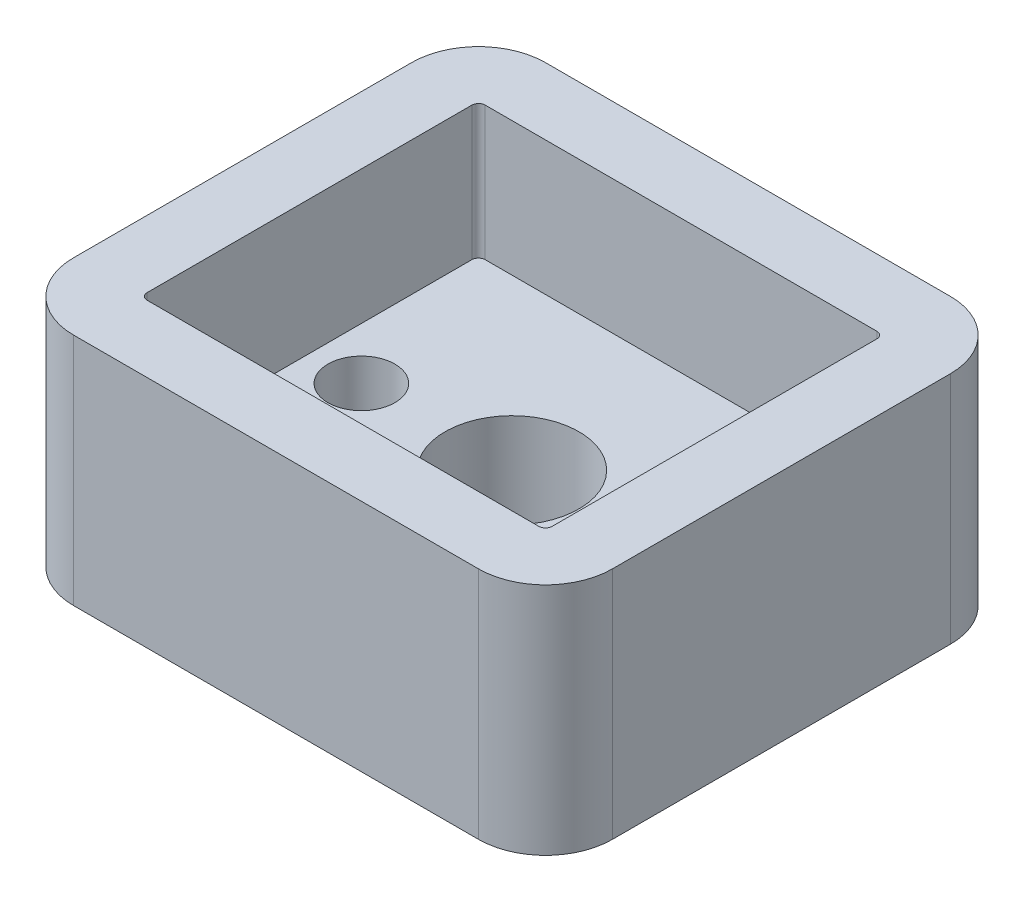
ISO-10303-21;
HEADER;
FILE_DESCRIPTION(('STEP AP214'),'2;1');
FILE_NAME('part.step','',(''),(''),'','','');
FILE_SCHEMA(('AUTOMOTIVE_DESIGN { 1 0 10303 214 1 1 1 1 }'));
ENDSEC;
DATA;
#1=APPLICATION_CONTEXT('core data for automotive mechanical design processes');
#2=APPLICATION_PROTOCOL_DEFINITION('international standard','automotive_design',2000,#1);
#3=PRODUCT_CONTEXT('',#1,'mechanical');
#4=PRODUCT('Part','Part','',(#3));
#5=PRODUCT_RELATED_PRODUCT_CATEGORY('part','',(#4));
#6=PRODUCT_DEFINITION_FORMATION('','',#4);
#7=PRODUCT_DEFINITION_CONTEXT('part definition',#1,'design');
#8=PRODUCT_DEFINITION('design','',#6,#7);
#9=PRODUCT_DEFINITION_SHAPE('','',#8);
#10=(LENGTH_UNIT() NAMED_UNIT(*) SI_UNIT(.MILLI.,.METRE.));
#11=(NAMED_UNIT(*) PLANE_ANGLE_UNIT() SI_UNIT($,.RADIAN.));
#12=(NAMED_UNIT(*) SI_UNIT($,.STERADIAN.) SOLID_ANGLE_UNIT());
#13=UNCERTAINTY_MEASURE_WITH_UNIT(LENGTH_MEASURE(1.E-05),#10,'distance_accuracy_value','');
#14=(GEOMETRIC_REPRESENTATION_CONTEXT(3) GLOBAL_UNCERTAINTY_ASSIGNED_CONTEXT((#13)) GLOBAL_UNIT_ASSIGNED_CONTEXT((#10,
#11,#12)) REPRESENTATION_CONTEXT('',''));
#15=CARTESIAN_POINT('',(0.,0.,0.));
#16=DIRECTION('',(0.,0.,1.));
#17=DIRECTION('',(1.,0.,0.));
#18=AXIS2_PLACEMENT_3D('',#15,#16,#17);
#19=CARTESIAN_POINT('',(0.,0.,0.));
#20=DIRECTION('',(0.,1.,0.));
#21=DIRECTION('',(0.,0.,1.));
#22=AXIS2_PLACEMENT_3D('',#19,#20,#21);
#23=PLANE('',#22);
#24=CARTESIAN_POINT('',(0.,0.,0.));
#25=DIRECTION('',(0.,1.,0.));
#26=DIRECTION('',(0.,0.,1.));
#27=AXIS2_PLACEMENT_3D('',#24,#25,#26);
#28=CIRCLE('',#27,2.);
#29=CARTESIAN_POINT('',(0.,0.,2.));
#30=VERTEX_POINT('',#29);
#31=EDGE_CURVE('E622',#30,#30,#28,.T.);
#32=ORIENTED_EDGE('',*,*,#31,.T.);
#33=EDGE_LOOP('',(#32));
#34=FACE_BOUND('',#33,.T.);
#35=CARTESIAN_POINT('',(4.5,0.,0.));
#36=DIRECTION('',(0.,-1.,0.));
#37=DIRECTION('',(0.,0.,-1.));
#38=AXIS2_PLACEMENT_3D('',#35,#36,#37);
#39=CIRCLE('',#38,2.);
#40=CARTESIAN_POINT('',(4.5,0.,-2.));
#41=VERTEX_POINT('',#40);
#42=EDGE_CURVE('E606',#41,#41,#39,.T.);
#43=ORIENTED_EDGE('',*,*,#42,.F.);
#44=EDGE_LOOP('',(#43));
#45=FACE_BOUND('',#44,.T.);
#46=DIRECTION('',(0.,0.,1.));
#47=VECTOR('',#46,1.);
#48=CARTESIAN_POINT('',(-8.05,0.,-7.05));
#49=LINE('',#48,#47);
#50=CARTESIAN_POINT('',(-8.05,0.,-5.05));
#51=VERTEX_POINT('',#50);
#52=CARTESIAN_POINT('',(-8.05,0.,5.05));
#53=VERTEX_POINT('',#52);
#54=EDGE_CURVE('E170',#51,#53,#49,.T.);
#55=ORIENTED_EDGE('',*,*,#54,.F.);
#56=CARTESIAN_POINT('',(-6.05,0.,-5.05));
#57=DIRECTION('',(0.,1.,0.));
#58=DIRECTION('',(0.,0.,1.));
#59=AXIS2_PLACEMENT_3D('',#56,#57,#58);
#60=CIRCLE('',#59,2.);
#61=CARTESIAN_POINT('',(-6.05,0.,-7.05));
#62=VERTEX_POINT('',#61);
#63=EDGE_CURVE('E152',#51,#62,#60,.F.);
#64=ORIENTED_EDGE('',*,*,#63,.T.);
#65=DIRECTION('',(-1.,0.,0.));
#66=VECTOR('',#65,1.);
#67=CARTESIAN_POINT('',(-8.05,0.,-7.05));
#68=LINE('',#67,#66);
#69=CARTESIAN_POINT('',(6.05,0.,-7.05));
#70=VERTEX_POINT('',#69);
#71=EDGE_CURVE('E200',#70,#62,#68,.T.);
#72=ORIENTED_EDGE('',*,*,#71,.F.);
#73=CARTESIAN_POINT('',(6.05,0.,-5.05));
#74=DIRECTION('',(0.,1.,0.));
#75=DIRECTION('',(0.,0.,1.));
#76=AXIS2_PLACEMENT_3D('',#73,#74,#75);
#77=CIRCLE('',#76,2.);
#78=CARTESIAN_POINT('',(8.05,0.,-5.05));
#79=VERTEX_POINT('',#78);
#80=EDGE_CURVE('E175',#70,#79,#77,.F.);
#81=ORIENTED_EDGE('',*,*,#80,.T.);
#82=DIRECTION('',(0.,0.,-1.));
#83=VECTOR('',#82,1.);
#84=CARTESIAN_POINT('',(8.05,0.,-7.05));
#85=LINE('',#84,#83);
#86=CARTESIAN_POINT('',(8.05,0.,5.05));
#87=VERTEX_POINT('',#86);
#88=EDGE_CURVE('E188',#87,#79,#85,.T.);
#89=ORIENTED_EDGE('',*,*,#88,.F.);
#90=CARTESIAN_POINT('',(6.05,0.,5.05));
#91=DIRECTION('',(0.,1.,0.));
#92=DIRECTION('',(0.,0.,1.));
#93=AXIS2_PLACEMENT_3D('',#90,#91,#92);
#94=CIRCLE('',#93,2.);
#95=CARTESIAN_POINT('',(6.05,0.,7.05));
#96=VERTEX_POINT('',#95);
#97=EDGE_CURVE('E164',#87,#96,#94,.F.);
#98=ORIENTED_EDGE('',*,*,#97,.T.);
#99=DIRECTION('',(1.,0.,0.));
#100=VECTOR('',#99,1.);
#101=CARTESIAN_POINT('',(-8.05,0.,7.05));
#102=LINE('',#101,#100);
#103=CARTESIAN_POINT('',(-6.05,0.,7.05));
#104=VERTEX_POINT('',#103);
#105=EDGE_CURVE('E182',#104,#96,#102,.T.);
#106=ORIENTED_EDGE('',*,*,#105,.F.);
#107=CARTESIAN_POINT('',(-6.05,0.,5.05));
#108=DIRECTION('',(0.,1.,0.));
#109=DIRECTION('',(0.,0.,1.));
#110=AXIS2_PLACEMENT_3D('',#107,#108,#109);
#111=CIRCLE('',#110,2.);
#112=EDGE_CURVE('E180',#104,#53,#111,.F.);
#113=ORIENTED_EDGE('',*,*,#112,.T.);
#114=EDGE_LOOP('',(#55,#64,#72,#81,#89,#98,#106,#113));
#115=FACE_BOUND('',#114,.T.);
#116=CARTESIAN_POINT('',(-4.5,0.,0.));
#117=DIRECTION('',(0.,-1.,0.));
#118=DIRECTION('',(0.,0.,-1.));
#119=AXIS2_PLACEMENT_3D('',#116,#117,#118);
#120=CIRCLE('',#119,2.);
#121=CARTESIAN_POINT('',(-4.5,0.,-2.));
#122=VERTEX_POINT('',#121);
#123=EDGE_CURVE('E618',#122,#122,#120,.T.);
#124=ORIENTED_EDGE('',*,*,#123,.F.);
#125=EDGE_LOOP('',(#124));
#126=FACE_BOUND('',#125,.T.);
#127=ADVANCED_FACE('F39',(#34,#45,#115,#126),#23,.F.);
#128=CARTESIAN_POINT('',(-8.05,7.,-7.05));
#129=DIRECTION('',(1.,0.,0.));
#130=DIRECTION('',(0.,0.,-1.));
#131=AXIS2_PLACEMENT_3D('',#128,#129,#130);
#132=PLANE('',#131);
#133=DIRECTION('',(0.,0.,1.));
#134=VECTOR('',#133,1.);
#135=CARTESIAN_POINT('',(-8.05,7.,-7.05));
#136=LINE('',#135,#134);
#137=CARTESIAN_POINT('',(-8.05,7.,-5.05));
#138=VERTEX_POINT('',#137);
#139=CARTESIAN_POINT('',(-8.05,7.,5.05));
#140=VERTEX_POINT('',#139);
#141=EDGE_CURVE('E173',#138,#140,#136,.T.);
#142=ORIENTED_EDGE('',*,*,#141,.F.);
#143=DIRECTION('',(0.,-1.,0.));
#144=VECTOR('',#143,1.);
#145=CARTESIAN_POINT('',(-8.05,7.,-5.05));
#146=LINE('',#145,#144);
#147=EDGE_CURVE('E156',#138,#51,#146,.T.);
#148=ORIENTED_EDGE('',*,*,#147,.T.);
#149=ORIENTED_EDGE('',*,*,#54,.T.);
#150=DIRECTION('',(0.,-1.,0.));
#151=VECTOR('',#150,1.);
#152=CARTESIAN_POINT('',(-8.05,7.,5.05));
#153=LINE('',#152,#151);
#154=EDGE_CURVE('E176',#53,#140,#153,.F.);
#155=ORIENTED_EDGE('',*,*,#154,.T.);
#156=EDGE_LOOP('',(#142,#148,#149,#155));
#157=FACE_BOUND('',#156,.T.);
#158=ADVANCED_FACE('F169',(#157),#132,.F.);
#159=CARTESIAN_POINT('',(-8.05,7.,7.05));
#160=DIRECTION('',(0.,0.,-1.));
#161=DIRECTION('',(-1.,0.,0.));
#162=AXIS2_PLACEMENT_3D('',#159,#160,#161);
#163=PLANE('',#162);
#164=ORIENTED_EDGE('',*,*,#105,.T.);
#165=DIRECTION('',(0.,-1.,0.));
#166=VECTOR('',#165,1.);
#167=CARTESIAN_POINT('',(6.05,7.,7.05));
#168=LINE('',#167,#166);
#169=CARTESIAN_POINT('',(6.05,7.,7.05));
#170=VERTEX_POINT('',#169);
#171=EDGE_CURVE('E239',#96,#170,#168,.F.);
#172=ORIENTED_EDGE('',*,*,#171,.T.);
#173=DIRECTION('',(1.,0.,0.));
#174=VECTOR('',#173,1.);
#175=CARTESIAN_POINT('',(-8.05,7.,7.05));
#176=LINE('',#175,#174);
#177=CARTESIAN_POINT('',(-6.05,7.,7.05));
#178=VERTEX_POINT('',#177);
#179=EDGE_CURVE('E343',#178,#170,#176,.T.);
#180=ORIENTED_EDGE('',*,*,#179,.F.);
#181=DIRECTION('',(0.,-1.,0.));
#182=VECTOR('',#181,1.);
#183=CARTESIAN_POINT('',(-6.05,7.,7.05));
#184=LINE('',#183,#182);
#185=EDGE_CURVE('E235',#178,#104,#184,.T.);
#186=ORIENTED_EDGE('',*,*,#185,.T.);
#187=EDGE_LOOP('',(#164,#172,#180,#186));
#188=FACE_BOUND('',#187,.T.);
#189=ADVANCED_FACE('F369',(#188),#163,.F.);
#190=CARTESIAN_POINT('',(8.05,7.,-7.05));
#191=DIRECTION('',(-1.,0.,0.));
#192=DIRECTION('',(0.,0.,1.));
#193=AXIS2_PLACEMENT_3D('',#190,#191,#192);
#194=PLANE('',#193);
#195=DIRECTION('',(0.,0.,-1.));
#196=VECTOR('',#195,1.);
#197=CARTESIAN_POINT('',(8.05,7.,-7.05));
#198=LINE('',#197,#196);
#199=CARTESIAN_POINT('',(8.05,7.,5.05));
#200=VERTEX_POINT('',#199);
#201=CARTESIAN_POINT('',(8.05,7.,-5.05));
#202=VERTEX_POINT('',#201);
#203=EDGE_CURVE('E346',#200,#202,#198,.T.);
#204=ORIENTED_EDGE('',*,*,#203,.F.);
#205=DIRECTION('',(0.,-1.,0.));
#206=VECTOR('',#205,1.);
#207=CARTESIAN_POINT('',(8.05,7.,5.05));
#208=LINE('',#207,#206);
#209=EDGE_CURVE('E231',#200,#87,#208,.T.);
#210=ORIENTED_EDGE('',*,*,#209,.T.);
#211=ORIENTED_EDGE('',*,*,#88,.T.);
#212=DIRECTION('',(0.,-1.,0.));
#213=VECTOR('',#212,1.);
#214=CARTESIAN_POINT('',(8.05,7.,-5.05));
#215=LINE('',#214,#213);
#216=EDGE_CURVE('E228',#79,#202,#215,.F.);
#217=ORIENTED_EDGE('',*,*,#216,.T.);
#218=EDGE_LOOP('',(#204,#210,#211,#217));
#219=FACE_BOUND('',#218,.T.);
#220=ADVANCED_FACE('F362',(#219),#194,.F.);
#221=CARTESIAN_POINT('',(-8.05,7.,-7.05));
#222=DIRECTION('',(0.,0.,1.));
#223=DIRECTION('',(1.,0.,0.));
#224=AXIS2_PLACEMENT_3D('',#221,#222,#223);
#225=PLANE('',#224);
#226=ORIENTED_EDGE('',*,*,#71,.T.);
#227=DIRECTION('',(0.,-1.,0.));
#228=VECTOR('',#227,1.);
#229=CARTESIAN_POINT('',(-6.05,7.,-7.05));
#230=LINE('',#229,#228);
#231=CARTESIAN_POINT('',(-6.05,7.,-7.05));
#232=VERTEX_POINT('',#231);
#233=EDGE_CURVE('E157',#62,#232,#230,.F.);
#234=ORIENTED_EDGE('',*,*,#233,.T.);
#235=DIRECTION('',(-1.,0.,0.));
#236=VECTOR('',#235,1.);
#237=CARTESIAN_POINT('',(-8.05,7.,-7.05));
#238=LINE('',#237,#236);
#239=CARTESIAN_POINT('',(6.05,7.,-7.05));
#240=VERTEX_POINT('',#239);
#241=EDGE_CURVE('E194',#240,#232,#238,.T.);
#242=ORIENTED_EDGE('',*,*,#241,.F.);
#243=DIRECTION('',(0.,-1.,0.));
#244=VECTOR('',#243,1.);
#245=CARTESIAN_POINT('',(6.05,7.,-7.05));
#246=LINE('',#245,#244);
#247=EDGE_CURVE('E163',#240,#70,#246,.T.);
#248=ORIENTED_EDGE('',*,*,#247,.T.);
#249=EDGE_LOOP('',(#226,#234,#242,#248));
#250=FACE_BOUND('',#249,.T.);
#251=ADVANCED_FACE('F356',(#250),#225,.F.);
#252=CARTESIAN_POINT('',(0.,7.,0.));
#253=DIRECTION('',(0.,1.,0.));
#254=DIRECTION('',(0.,0.,1.));
#255=AXIS2_PLACEMENT_3D('',#252,#253,#254);
#256=PLANE('',#255);
#257=DIRECTION('',(0.,0.,1.));
#258=VECTOR('',#257,1.);
#259=CARTESIAN_POINT('',(-6.05,7.,-5.05));
#260=LINE('',#259,#258);
#261=CARTESIAN_POINT('',(-6.05,7.,-4.85));
#262=VERTEX_POINT('',#261);
#263=CARTESIAN_POINT('',(-6.05,7.,4.85));
#264=VERTEX_POINT('',#263);
#265=EDGE_CURVE('E291',#262,#264,#260,.T.);
#266=ORIENTED_EDGE('',*,*,#265,.F.);
#267=CARTESIAN_POINT('',(-5.85,7.,-4.85));
#268=DIRECTION('',(0.,1.,0.));
#269=DIRECTION('',(0.,0.,1.));
#270=AXIS2_PLACEMENT_3D('',#267,#268,#269);
#271=CIRCLE('',#270,0.2);
#272=CARTESIAN_POINT('',(-5.85,7.,-5.05));
#273=VERTEX_POINT('',#272);
#274=EDGE_CURVE('E281',#262,#273,#271,.F.);
#275=ORIENTED_EDGE('',*,*,#274,.T.);
#276=DIRECTION('',(-1.,0.,0.));
#277=VECTOR('',#276,1.);
#278=CARTESIAN_POINT('',(-6.05,7.,-5.05));
#279=LINE('',#278,#277);
#280=CARTESIAN_POINT('',(5.85,7.,-5.05));
#281=VERTEX_POINT('',#280);
#282=EDGE_CURVE('E323',#281,#273,#279,.T.);
#283=ORIENTED_EDGE('',*,*,#282,.F.);
#284=CARTESIAN_POINT('',(5.85,7.,-4.85));
#285=DIRECTION('',(0.,1.,0.));
#286=DIRECTION('',(0.,0.,1.));
#287=AXIS2_PLACEMENT_3D('',#284,#285,#286);
#288=CIRCLE('',#287,0.2);
#289=CARTESIAN_POINT('',(6.05,7.,-4.85));
#290=VERTEX_POINT('',#289);
#291=EDGE_CURVE('E284',#281,#290,#288,.F.);
#292=ORIENTED_EDGE('',*,*,#291,.T.);
#293=DIRECTION('',(0.,0.,-1.));
#294=VECTOR('',#293,1.);
#295=CARTESIAN_POINT('',(6.05,7.,-5.05));
#296=LINE('',#295,#294);
#297=CARTESIAN_POINT('',(6.05,7.,4.85));
#298=VERTEX_POINT('',#297);
#299=EDGE_CURVE('E330',#298,#290,#296,.T.);
#300=ORIENTED_EDGE('',*,*,#299,.F.);
#301=CARTESIAN_POINT('',(5.85,7.,4.85));
#302=DIRECTION('',(0.,1.,0.));
#303=DIRECTION('',(0.,0.,1.));
#304=AXIS2_PLACEMENT_3D('',#301,#302,#303);
#305=CIRCLE('',#304,0.2);
#306=CARTESIAN_POINT('',(5.85,7.,5.05));
#307=VERTEX_POINT('',#306);
#308=EDGE_CURVE('E12',#298,#307,#305,.F.);
#309=ORIENTED_EDGE('',*,*,#308,.T.);
#310=DIRECTION('',(1.,0.,0.));
#311=VECTOR('',#310,1.);
#312=CARTESIAN_POINT('',(-6.05,7.,5.05));
#313=LINE('',#312,#311);
#314=CARTESIAN_POINT('',(-5.85,7.,5.05));
#315=VERTEX_POINT('',#314);
#316=EDGE_CURVE('E292',#315,#307,#313,.T.);
#317=ORIENTED_EDGE('',*,*,#316,.F.);
#318=CARTESIAN_POINT('',(-5.85,7.,4.85));
#319=DIRECTION('',(0.,1.,0.));
#320=DIRECTION('',(0.,0.,1.));
#321=AXIS2_PLACEMENT_3D('',#318,#319,#320);
#322=CIRCLE('',#321,0.2);
#323=EDGE_CURVE('E48',#315,#264,#322,.F.);
#324=ORIENTED_EDGE('',*,*,#323,.T.);
#325=EDGE_LOOP('',(#266,#275,#283,#292,#300,#309,#317,#324));
#326=FACE_BOUND('',#325,.T.);
#327=ORIENTED_EDGE('',*,*,#241,.T.);
#328=CARTESIAN_POINT('',(-6.05,7.,-5.05));
#329=DIRECTION('',(0.,1.,0.));
#330=DIRECTION('',(0.,0.,1.));
#331=AXIS2_PLACEMENT_3D('',#328,#329,#330);
#332=CIRCLE('',#331,2.);
#333=EDGE_CURVE('E225',#232,#138,#332,.T.);
#334=ORIENTED_EDGE('',*,*,#333,.T.);
#335=ORIENTED_EDGE('',*,*,#141,.T.);
#336=CARTESIAN_POINT('',(-6.05,7.,5.05));
#337=DIRECTION('',(0.,1.,0.));
#338=DIRECTION('',(0.,0.,1.));
#339=AXIS2_PLACEMENT_3D('',#336,#337,#338);
#340=CIRCLE('',#339,2.);
#341=EDGE_CURVE('E219',#140,#178,#340,.T.);
#342=ORIENTED_EDGE('',*,*,#341,.T.);
#343=ORIENTED_EDGE('',*,*,#179,.T.);
#344=CARTESIAN_POINT('',(6.05,7.,5.05));
#345=DIRECTION('',(0.,1.,0.));
#346=DIRECTION('',(0.,0.,1.));
#347=AXIS2_PLACEMENT_3D('',#344,#345,#346);
#348=CIRCLE('',#347,2.);
#349=EDGE_CURVE('E222',#170,#200,#348,.T.);
#350=ORIENTED_EDGE('',*,*,#349,.T.);
#351=ORIENTED_EDGE('',*,*,#203,.T.);
#352=CARTESIAN_POINT('',(6.05,7.,-5.05));
#353=DIRECTION('',(0.,1.,0.));
#354=DIRECTION('',(0.,0.,1.));
#355=AXIS2_PLACEMENT_3D('',#352,#353,#354);
#356=CIRCLE('',#355,2.);
#357=EDGE_CURVE('E216',#202,#240,#356,.T.);
#358=ORIENTED_EDGE('',*,*,#357,.T.);
#359=EDGE_LOOP('',(#327,#334,#335,#342,#343,#350,#351,#358));
#360=FACE_BOUND('',#359,.T.);
#361=ADVANCED_FACE('F289',(#326,#360),#256,.T.);
#362=CARTESIAN_POINT('',(-6.05,-15.7613451202618,-5.05));
#363=DIRECTION('',(-1.,0.,0.));
#364=DIRECTION('',(0.,0.,1.));
#365=AXIS2_PLACEMENT_3D('',#362,#363,#364);
#366=PLANE('',#365);
#367=DIRECTION('',(0.,0.,-1.));
#368=VECTOR('',#367,1.);
#369=CARTESIAN_POINT('',(-6.05,3.,-5.05));
#370=LINE('',#369,#368);
#371=CARTESIAN_POINT('',(-6.05,3.,4.85));
#372=VERTEX_POINT('',#371);
#373=CARTESIAN_POINT('',(-6.05,3.,-4.85));
#374=VERTEX_POINT('',#373);
#375=EDGE_CURVE('E191',#372,#374,#370,.T.);
#376=ORIENTED_EDGE('',*,*,#375,.T.);
#377=DIRECTION('',(0.,1.,0.));
#378=VECTOR('',#377,1.);
#379=CARTESIAN_POINT('',(-6.05,7.,-4.85));
#380=LINE('',#379,#378);
#381=EDGE_CURVE('E245',#374,#262,#380,.T.);
#382=ORIENTED_EDGE('',*,*,#381,.T.);
#383=ORIENTED_EDGE('',*,*,#265,.T.);
#384=DIRECTION('',(0.,1.,0.));
#385=VECTOR('',#384,1.);
#386=CARTESIAN_POINT('',(-6.05,3.,4.85));
#387=LINE('',#386,#385);
#388=EDGE_CURVE('E242',#264,#372,#387,.F.);
#389=ORIENTED_EDGE('',*,*,#388,.T.);
#390=EDGE_LOOP('',(#376,#382,#383,#389));
#391=FACE_BOUND('',#390,.T.);
#392=ADVANCED_FACE('F295',(#391),#366,.F.);
#393=CARTESIAN_POINT('',(-6.05,-15.7613451202618,-5.05));
#394=DIRECTION('',(0.,0.,-1.));
#395=DIRECTION('',(-1.,0.,0.));
#396=AXIS2_PLACEMENT_3D('',#393,#394,#395);
#397=PLANE('',#396);
#398=ORIENTED_EDGE('',*,*,#282,.T.);
#399=DIRECTION('',(0.,1.,0.));
#400=VECTOR('',#399,1.);
#401=CARTESIAN_POINT('',(-5.85,3.,-5.05));
#402=LINE('',#401,#400);
#403=CARTESIAN_POINT('',(-5.85,3.,-5.05));
#404=VERTEX_POINT('',#403);
#405=EDGE_CURVE('E253',#273,#404,#402,.F.);
#406=ORIENTED_EDGE('',*,*,#405,.T.);
#407=DIRECTION('',(1.,0.,0.));
#408=VECTOR('',#407,1.);
#409=CARTESIAN_POINT('',(-6.05,3.,-5.05));
#410=LINE('',#409,#408);
#411=CARTESIAN_POINT('',(5.85,3.,-5.05));
#412=VERTEX_POINT('',#411);
#413=EDGE_CURVE('E322',#404,#412,#410,.T.);
#414=ORIENTED_EDGE('',*,*,#413,.T.);
#415=DIRECTION('',(0.,1.,0.));
#416=VECTOR('',#415,1.);
#417=CARTESIAN_POINT('',(5.85,7.,-5.05));
#418=LINE('',#417,#416);
#419=EDGE_CURVE('E249',#412,#281,#418,.T.);
#420=ORIENTED_EDGE('',*,*,#419,.T.);
#421=EDGE_LOOP('',(#398,#406,#414,#420));
#422=FACE_BOUND('',#421,.T.);
#423=ADVANCED_FACE('F433',(#422),#397,.F.);
#424=CARTESIAN_POINT('',(6.05,-15.7613451202618,-5.05));
#425=DIRECTION('',(1.,0.,0.));
#426=DIRECTION('',(0.,0.,-1.));
#427=AXIS2_PLACEMENT_3D('',#424,#425,#426);
#428=PLANE('',#427);
#429=ORIENTED_EDGE('',*,*,#299,.T.);
#430=DIRECTION('',(0.,1.,0.));
#431=VECTOR('',#430,1.);
#432=CARTESIAN_POINT('',(6.05,3.,-4.85));
#433=LINE('',#432,#431);
#434=CARTESIAN_POINT('',(6.05,3.,-4.85));
#435=VERTEX_POINT('',#434);
#436=EDGE_CURVE('E272',#290,#435,#433,.F.);
#437=ORIENTED_EDGE('',*,*,#436,.T.);
#438=DIRECTION('',(0.,0.,1.));
#439=VECTOR('',#438,1.);
#440=CARTESIAN_POINT('',(6.05,3.,-5.05));
#441=LINE('',#440,#439);
#442=CARTESIAN_POINT('',(6.05,3.,4.85));
#443=VERTEX_POINT('',#442);
#444=EDGE_CURVE('E315',#435,#443,#441,.T.);
#445=ORIENTED_EDGE('',*,*,#444,.T.);
#446=DIRECTION('',(0.,1.,0.));
#447=VECTOR('',#446,1.);
#448=CARTESIAN_POINT('',(6.05,7.,4.85));
#449=LINE('',#448,#447);
#450=EDGE_CURVE('E268',#443,#298,#449,.T.);
#451=ORIENTED_EDGE('',*,*,#450,.T.);
#452=EDGE_LOOP('',(#429,#437,#445,#451));
#453=FACE_BOUND('',#452,.T.);
#454=ADVANCED_FACE('F319',(#453),#428,.F.);
#455=CARTESIAN_POINT('',(-6.05,-15.7613451202618,5.05));
#456=DIRECTION('',(0.,0.,1.));
#457=DIRECTION('',(1.,0.,0.));
#458=AXIS2_PLACEMENT_3D('',#455,#456,#457);
#459=PLANE('',#458);
#460=DIRECTION('',(-1.,0.,0.));
#461=VECTOR('',#460,1.);
#462=CARTESIAN_POINT('',(-6.05,3.,5.05));
#463=LINE('',#462,#461);
#464=CARTESIAN_POINT('',(5.85,3.,5.05));
#465=VERTEX_POINT('',#464);
#466=CARTESIAN_POINT('',(-5.85,3.,5.05));
#467=VERTEX_POINT('',#466);
#468=EDGE_CURVE('E183',#465,#467,#463,.T.);
#469=ORIENTED_EDGE('',*,*,#468,.T.);
#470=DIRECTION('',(0.,1.,0.));
#471=VECTOR('',#470,1.);
#472=CARTESIAN_POINT('',(-5.85,7.,5.05));
#473=LINE('',#472,#471);
#474=EDGE_CURVE('E278',#467,#315,#473,.T.);
#475=ORIENTED_EDGE('',*,*,#474,.T.);
#476=ORIENTED_EDGE('',*,*,#316,.T.);
#477=DIRECTION('',(0.,1.,0.));
#478=VECTOR('',#477,1.);
#479=CARTESIAN_POINT('',(5.85,3.,5.05));
#480=LINE('',#479,#478);
#481=EDGE_CURVE('E275',#307,#465,#480,.F.);
#482=ORIENTED_EDGE('',*,*,#481,.T.);
#483=EDGE_LOOP('',(#469,#475,#476,#482));
#484=FACE_BOUND('',#483,.T.);
#485=ADVANCED_FACE('F309',(#484),#459,.F.);
#486=CARTESIAN_POINT('',(0.,3.,0.));
#487=DIRECTION('',(0.,1.,0.));
#488=DIRECTION('',(0.,0.,1.));
#489=AXIS2_PLACEMENT_3D('',#486,#487,#488);
#490=PLANE('',#489);
#491=CARTESIAN_POINT('',(0.,3.,0.));
#492=DIRECTION('',(0.,1.,0.));
#493=DIRECTION('',(0.,0.,1.));
#494=AXIS2_PLACEMENT_3D('',#491,#492,#493);
#495=CIRCLE('',#494,2.);
#496=CARTESIAN_POINT('',(0.,3.,2.));
#497=VERTEX_POINT('',#496);
#498=EDGE_CURVE('E594',#497,#497,#495,.T.);
#499=ORIENTED_EDGE('',*,*,#498,.F.);
#500=EDGE_LOOP('',(#499));
#501=FACE_BOUND('',#500,.T.);
#502=CARTESIAN_POINT('',(-4.5,3.,0.));
#503=DIRECTION('',(0.,1.,0.));
#504=DIRECTION('',(0.,0.,1.));
#505=AXIS2_PLACEMENT_3D('',#502,#503,#504);
#506=CIRCLE('',#505,0.999999999999999);
#507=CARTESIAN_POINT('',(-4.5,3.,0.999999999999999));
#508=VERTEX_POINT('',#507);
#509=EDGE_CURVE('E598',#508,#508,#506,.T.);
#510=ORIENTED_EDGE('',*,*,#509,.F.);
#511=EDGE_LOOP('',(#510));
#512=FACE_BOUND('',#511,.T.);
#513=CARTESIAN_POINT('',(4.5,3.,0.));
#514=DIRECTION('',(0.,1.,0.));
#515=DIRECTION('',(0.,0.,1.));
#516=AXIS2_PLACEMENT_3D('',#513,#514,#515);
#517=CIRCLE('',#516,0.999999999999999);
#518=CARTESIAN_POINT('',(4.5,3.,0.999999999999999));
#519=VERTEX_POINT('',#518);
#520=EDGE_CURVE('E299',#519,#519,#517,.T.);
#521=ORIENTED_EDGE('',*,*,#520,.F.);
#522=EDGE_LOOP('',(#521));
#523=FACE_BOUND('',#522,.T.);
#524=ORIENTED_EDGE('',*,*,#413,.F.);
#525=CARTESIAN_POINT('',(-5.85,3.,-4.85));
#526=DIRECTION('',(0.,1.,0.));
#527=DIRECTION('',(0.,0.,1.));
#528=AXIS2_PLACEMENT_3D('',#525,#526,#527);
#529=CIRCLE('',#528,0.2);
#530=EDGE_CURVE('E265',#404,#374,#529,.T.);
#531=ORIENTED_EDGE('',*,*,#530,.T.);
#532=ORIENTED_EDGE('',*,*,#375,.F.);
#533=CARTESIAN_POINT('',(-5.85,3.,4.85));
#534=DIRECTION('',(0.,1.,0.));
#535=DIRECTION('',(0.,0.,1.));
#536=AXIS2_PLACEMENT_3D('',#533,#534,#535);
#537=CIRCLE('',#536,0.2);
#538=EDGE_CURVE('E259',#372,#467,#537,.T.);
#539=ORIENTED_EDGE('',*,*,#538,.T.);
#540=ORIENTED_EDGE('',*,*,#468,.F.);
#541=CARTESIAN_POINT('',(5.85,3.,4.85));
#542=DIRECTION('',(0.,1.,0.));
#543=DIRECTION('',(0.,0.,1.));
#544=AXIS2_PLACEMENT_3D('',#541,#542,#543);
#545=CIRCLE('',#544,0.2);
#546=EDGE_CURVE('E256',#465,#443,#545,.T.);
#547=ORIENTED_EDGE('',*,*,#546,.T.);
#548=ORIENTED_EDGE('',*,*,#444,.F.);
#549=CARTESIAN_POINT('',(5.85,3.,-4.85));
#550=DIRECTION('',(0.,1.,0.));
#551=DIRECTION('',(0.,0.,1.));
#552=AXIS2_PLACEMENT_3D('',#549,#550,#551);
#553=CIRCLE('',#552,0.2);
#554=EDGE_CURVE('E262',#435,#412,#553,.T.);
#555=ORIENTED_EDGE('',*,*,#554,.T.);
#556=EDGE_LOOP('',(#524,#531,#532,#539,#540,#547,#548,#555));
#557=FACE_BOUND('',#556,.T.);
#558=ADVANCED_FACE('F306',(#501,#512,#523,#557),#490,.T.);
#559=CARTESIAN_POINT('',(4.5,0.,0.));
#560=DIRECTION('',(0.,-1.,0.));
#561=DIRECTION('',(0.,0.,-1.));
#562=AXIS2_PLACEMENT_3D('',#559,#560,#561);
#563=CYLINDRICAL_SURFACE('',#562,0.999999999999999);
#564=CARTESIAN_POINT('',(4.5,1.,0.));
#565=DIRECTION('',(0.,-1.,0.));
#566=DIRECTION('',(0.,0.,-1.));
#567=AXIS2_PLACEMENT_3D('',#564,#565,#566);
#568=CIRCLE('',#567,0.999999999999999);
#569=CARTESIAN_POINT('',(4.5,1.,-0.999999999999999));
#570=VERTEX_POINT('',#569);
#571=EDGE_CURVE('E603',#570,#570,#568,.T.);
#572=ORIENTED_EDGE('',*,*,#571,.T.);
#573=EDGE_LOOP('',(#572));
#574=FACE_BOUND('',#573,.T.);
#575=ORIENTED_EDGE('',*,*,#520,.T.);
#576=EDGE_LOOP('',(#575));
#577=FACE_BOUND('',#576,.T.);
#578=ADVANCED_FACE('F425',(#574,#577),#563,.F.);
#579=CARTESIAN_POINT('',(4.5,0.,0.));
#580=DIRECTION('',(0.,-1.,0.));
#581=DIRECTION('',(0.,0.,-1.));
#582=AXIS2_PLACEMENT_3D('',#579,#580,#581);
#583=CONICAL_SURFACE('',#582,2.,0.785398163397449);
#584=ORIENTED_EDGE('',*,*,#571,.F.);
#585=EDGE_LOOP('',(#584));
#586=FACE_BOUND('',#585,.T.);
#587=ORIENTED_EDGE('',*,*,#42,.T.);
#588=EDGE_LOOP('',(#587));
#589=FACE_BOUND('',#588,.T.);
#590=ADVANCED_FACE('F421',(#586,#589),#583,.F.);
#591=CARTESIAN_POINT('',(-4.5,0.,0.));
#592=DIRECTION('',(0.,-1.,0.));
#593=DIRECTION('',(0.,0.,-1.));
#594=AXIS2_PLACEMENT_3D('',#591,#592,#593);
#595=CYLINDRICAL_SURFACE('',#594,0.999999999999999);
#596=CARTESIAN_POINT('',(-4.5,1.,0.));
#597=DIRECTION('',(0.,-1.,0.));
#598=DIRECTION('',(0.,0.,-1.));
#599=AXIS2_PLACEMENT_3D('',#596,#597,#598);
#600=CIRCLE('',#599,0.999999999999999);
#601=CARTESIAN_POINT('',(-4.5,1.,-0.999999999999999));
#602=VERTEX_POINT('',#601);
#603=EDGE_CURVE('E614',#602,#602,#600,.T.);
#604=ORIENTED_EDGE('',*,*,#603,.T.);
#605=EDGE_LOOP('',(#604));
#606=FACE_BOUND('',#605,.T.);
#607=ORIENTED_EDGE('',*,*,#509,.T.);
#608=EDGE_LOOP('',(#607));
#609=FACE_BOUND('',#608,.T.);
#610=ADVANCED_FACE('F413',(#606,#609),#595,.F.);
#611=CARTESIAN_POINT('',(-4.5,0.,0.));
#612=DIRECTION('',(0.,-1.,0.));
#613=DIRECTION('',(0.,0.,-1.));
#614=AXIS2_PLACEMENT_3D('',#611,#612,#613);
#615=CONICAL_SURFACE('',#614,2.,0.785398163397449);
#616=ORIENTED_EDGE('',*,*,#603,.F.);
#617=EDGE_LOOP('',(#616));
#618=FACE_BOUND('',#617,.T.);
#619=ORIENTED_EDGE('',*,*,#123,.T.);
#620=EDGE_LOOP('',(#619));
#621=FACE_BOUND('',#620,.T.);
#622=ADVANCED_FACE('F408',(#618,#621),#615,.F.);
#623=CARTESIAN_POINT('',(0.,0.,0.));
#624=DIRECTION('',(0.,1.,0.));
#625=DIRECTION('',(0.,0.,1.));
#626=AXIS2_PLACEMENT_3D('',#623,#624,#625);
#627=CYLINDRICAL_SURFACE('',#626,2.);
#628=ORIENTED_EDGE('',*,*,#31,.F.);
#629=EDGE_LOOP('',(#628));
#630=FACE_BOUND('',#629,.T.);
#631=ORIENTED_EDGE('',*,*,#498,.T.);
#632=EDGE_LOOP('',(#631));
#633=FACE_BOUND('',#632,.T.);
#634=ADVANCED_FACE('F404',(#630,#633),#627,.F.);
#635=CARTESIAN_POINT('',(-6.05,7.,-5.05));
#636=DIRECTION('',(0.,-1.,0.));
#637=DIRECTION('',(0.,0.,-1.));
#638=AXIS2_PLACEMENT_3D('',#635,#636,#637);
#639=CYLINDRICAL_SURFACE('',#638,2.);
#640=ORIENTED_EDGE('',*,*,#333,.F.);
#641=ORIENTED_EDGE('',*,*,#233,.F.);
#642=ORIENTED_EDGE('',*,*,#63,.F.);
#643=ORIENTED_EDGE('',*,*,#147,.F.);
#644=EDGE_LOOP('',(#640,#641,#642,#643));
#645=FACE_BOUND('',#644,.T.);
#646=ADVANCED_FACE('F155',(#645),#639,.T.);
#647=CARTESIAN_POINT('',(6.05,7.,5.05));
#648=DIRECTION('',(0.,-1.,0.));
#649=DIRECTION('',(0.,0.,-1.));
#650=AXIS2_PLACEMENT_3D('',#647,#648,#649);
#651=CYLINDRICAL_SURFACE('',#650,2.);
#652=ORIENTED_EDGE('',*,*,#349,.F.);
#653=ORIENTED_EDGE('',*,*,#171,.F.);
#654=ORIENTED_EDGE('',*,*,#97,.F.);
#655=ORIENTED_EDGE('',*,*,#209,.F.);
#656=EDGE_LOOP('',(#652,#653,#654,#655));
#657=FACE_BOUND('',#656,.T.);
#658=ADVANCED_FACE('F366',(#657),#651,.T.);
#659=CARTESIAN_POINT('',(-6.05,7.,5.05));
#660=DIRECTION('',(0.,-1.,0.));
#661=DIRECTION('',(0.,0.,-1.));
#662=AXIS2_PLACEMENT_3D('',#659,#660,#661);
#663=CYLINDRICAL_SURFACE('',#662,2.);
#664=ORIENTED_EDGE('',*,*,#341,.F.);
#665=ORIENTED_EDGE('',*,*,#154,.F.);
#666=ORIENTED_EDGE('',*,*,#112,.F.);
#667=ORIENTED_EDGE('',*,*,#185,.F.);
#668=EDGE_LOOP('',(#664,#665,#666,#667));
#669=FACE_BOUND('',#668,.T.);
#670=ADVANCED_FACE('F374',(#669),#663,.T.);
#671=CARTESIAN_POINT('',(6.05,7.,-5.05));
#672=DIRECTION('',(0.,-1.,0.));
#673=DIRECTION('',(0.,0.,-1.));
#674=AXIS2_PLACEMENT_3D('',#671,#672,#673);
#675=CYLINDRICAL_SURFACE('',#674,2.);
#676=ORIENTED_EDGE('',*,*,#357,.F.);
#677=ORIENTED_EDGE('',*,*,#216,.F.);
#678=ORIENTED_EDGE('',*,*,#80,.F.);
#679=ORIENTED_EDGE('',*,*,#247,.F.);
#680=EDGE_LOOP('',(#676,#677,#678,#679));
#681=FACE_BOUND('',#680,.T.);
#682=ADVANCED_FACE('F358',(#681),#675,.T.);
#683=CARTESIAN_POINT('',(-5.85,-15.7613451202618,-4.85));
#684=DIRECTION('',(0.,-1.,0.));
#685=DIRECTION('',(0.,0.,-1.));
#686=AXIS2_PLACEMENT_3D('',#683,#684,#685);
#687=CYLINDRICAL_SURFACE('',#686,0.2);
#688=ORIENTED_EDGE('',*,*,#530,.F.);
#689=ORIENTED_EDGE('',*,*,#405,.F.);
#690=ORIENTED_EDGE('',*,*,#274,.F.);
#691=ORIENTED_EDGE('',*,*,#381,.F.);
#692=EDGE_LOOP('',(#688,#689,#690,#691));
#693=FACE_BOUND('',#692,.T.);
#694=ADVANCED_FACE('F381',(#693),#687,.F.);
#695=CARTESIAN_POINT('',(5.85,-15.7613451202618,-4.85));
#696=DIRECTION('',(0.,-1.,0.));
#697=DIRECTION('',(0.,0.,-1.));
#698=AXIS2_PLACEMENT_3D('',#695,#696,#697);
#699=CYLINDRICAL_SURFACE('',#698,0.2);
#700=ORIENTED_EDGE('',*,*,#554,.F.);
#701=ORIENTED_EDGE('',*,*,#436,.F.);
#702=ORIENTED_EDGE('',*,*,#291,.F.);
#703=ORIENTED_EDGE('',*,*,#419,.F.);
#704=EDGE_LOOP('',(#700,#701,#702,#703));
#705=FACE_BOUND('',#704,.T.);
#706=ADVANCED_FACE('F559',(#705),#699,.F.);
#707=CARTESIAN_POINT('',(-5.85,-15.7613451202618,4.85));
#708=DIRECTION('',(0.,-1.,0.));
#709=DIRECTION('',(0.,0.,-1.));
#710=AXIS2_PLACEMENT_3D('',#707,#708,#709);
#711=CYLINDRICAL_SURFACE('',#710,0.2);
#712=ORIENTED_EDGE('',*,*,#538,.F.);
#713=ORIENTED_EDGE('',*,*,#388,.F.);
#714=ORIENTED_EDGE('',*,*,#323,.F.);
#715=ORIENTED_EDGE('',*,*,#474,.F.);
#716=EDGE_LOOP('',(#712,#713,#714,#715));
#717=FACE_BOUND('',#716,.T.);
#718=ADVANCED_FACE('F302',(#717),#711,.F.);
#719=CARTESIAN_POINT('',(5.85,-15.7613451202618,4.85));
#720=DIRECTION('',(0.,-1.,0.));
#721=DIRECTION('',(0.,0.,-1.));
#722=AXIS2_PLACEMENT_3D('',#719,#720,#721);
#723=CYLINDRICAL_SURFACE('',#722,0.2);
#724=ORIENTED_EDGE('',*,*,#546,.F.);
#725=ORIENTED_EDGE('',*,*,#481,.F.);
#726=ORIENTED_EDGE('',*,*,#308,.F.);
#727=ORIENTED_EDGE('',*,*,#450,.F.);
#728=EDGE_LOOP('',(#724,#725,#726,#727));
#729=FACE_BOUND('',#728,.T.);
#730=ADVANCED_FACE('F41',(#729),#723,.F.);
#731=CLOSED_SHELL('',(#127,#158,#189,#220,#251,#361,#392,#423,#454,#485,#558,#578,#590,#610,
#622,#634,#646,#658,#670,#682,#694,#706,#718,#730));
#732=MANIFOLD_SOLID_BREP('B2',#731);
#733=ADVANCED_BREP_SHAPE_REPRESENTATION('',(#18,#732),#14);
#734=SHAPE_DEFINITION_REPRESENTATION(#9,#733);
ENDSEC;
END-ISO-10303-21;
